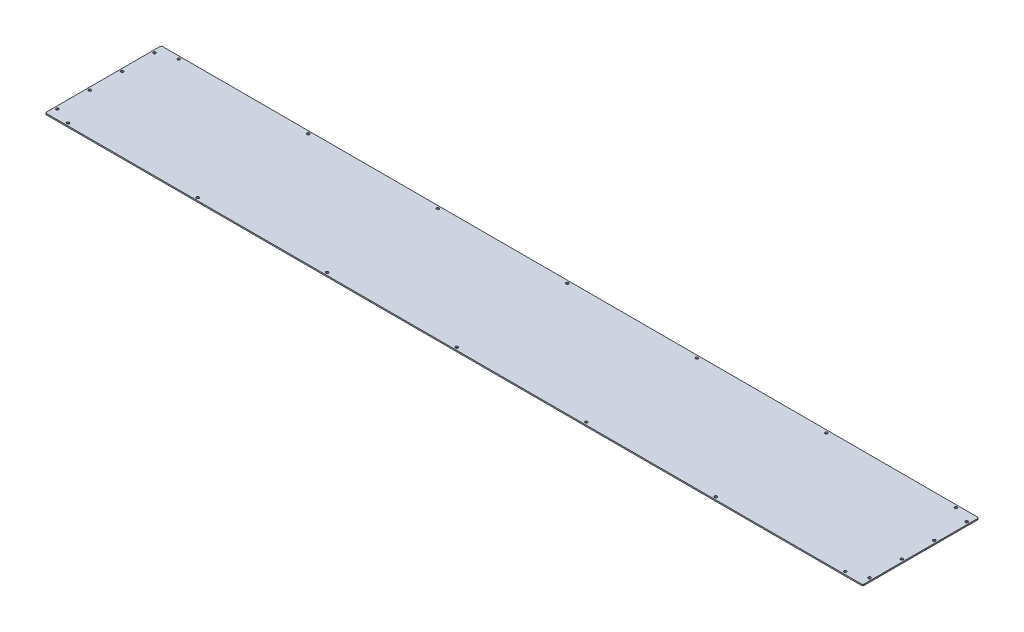
ISO-10303-21;
HEADER;
FILE_DESCRIPTION(('STEP AP214'),'2;1');
FILE_NAME('part.step','',(''),(''),'','','');
FILE_SCHEMA(('AUTOMOTIVE_DESIGN { 1 0 10303 214 1 1 1 1 }'));
ENDSEC;
DATA;
#1=APPLICATION_CONTEXT('core data for automotive mechanical design processes');
#2=APPLICATION_PROTOCOL_DEFINITION('international standard','automotive_design',2000,#1);
#3=PRODUCT_CONTEXT('',#1,'mechanical');
#4=PRODUCT('Part','Part','',(#3));
#5=PRODUCT_RELATED_PRODUCT_CATEGORY('part','',(#4));
#6=PRODUCT_DEFINITION_FORMATION('','',#4);
#7=PRODUCT_DEFINITION_CONTEXT('part definition',#1,'design');
#8=PRODUCT_DEFINITION('design','',#6,#7);
#9=PRODUCT_DEFINITION_SHAPE('','',#8);
#10=(LENGTH_UNIT() NAMED_UNIT(*) SI_UNIT(.MILLI.,.METRE.));
#11=(NAMED_UNIT(*) PLANE_ANGLE_UNIT() SI_UNIT($,.RADIAN.));
#12=(NAMED_UNIT(*) SI_UNIT($,.STERADIAN.) SOLID_ANGLE_UNIT());
#13=UNCERTAINTY_MEASURE_WITH_UNIT(LENGTH_MEASURE(1.E-05),#10,'distance_accuracy_value','');
#14=(GEOMETRIC_REPRESENTATION_CONTEXT(3) GLOBAL_UNCERTAINTY_ASSIGNED_CONTEXT((#13)) GLOBAL_UNIT_ASSIGNED_CONTEXT((#10,
#11,#12)) REPRESENTATION_CONTEXT('',''));
#15=CARTESIAN_POINT('',(0.,0.,0.));
#16=DIRECTION('',(0.,0.,1.));
#17=DIRECTION('',(1.,0.,0.));
#18=AXIS2_PLACEMENT_3D('',#15,#16,#17);
#19=CARTESIAN_POINT('',(962.025,2.9972,-136.525));
#20=DIRECTION('',(-1.,0.,0.));
#21=DIRECTION('',(0.,0.,1.));
#22=AXIS2_PLACEMENT_3D('',#19,#20,#21);
#23=PLANE('',#22);
#24=DIRECTION('',(0.,0.,-1.));
#25=VECTOR('',#24,1.);
#26=CARTESIAN_POINT('',(962.025,2.9972,-136.525));
#27=LINE('',#26,#25);
#28=CARTESIAN_POINT('',(962.025,2.9972,133.35));
#29=VERTEX_POINT('',#28);
#30=CARTESIAN_POINT('',(962.025,2.9972,-133.35));
#31=VERTEX_POINT('',#30);
#32=EDGE_CURVE('E118',#29,#31,#27,.T.);
#33=ORIENTED_EDGE('',*,*,#32,.F.);
#34=DIRECTION('',(0.,-1.,0.));
#35=VECTOR('',#34,1.);
#36=CARTESIAN_POINT('',(962.025,2.9972,133.35));
#37=LINE('',#36,#35);
#38=CARTESIAN_POINT('',(962.025,0.,133.35));
#39=VERTEX_POINT('',#38);
#40=EDGE_CURVE('E103',#29,#39,#37,.T.);
#41=ORIENTED_EDGE('',*,*,#40,.T.);
#42=DIRECTION('',(0.,0.,-1.));
#43=VECTOR('',#42,1.);
#44=CARTESIAN_POINT('',(962.025,0.,-136.525));
#45=LINE('',#44,#43);
#46=CARTESIAN_POINT('',(962.025,0.,-133.35));
#47=VERTEX_POINT('',#46);
#48=EDGE_CURVE('E115',#39,#47,#45,.T.);
#49=ORIENTED_EDGE('',*,*,#48,.T.);
#50=DIRECTION('',(0.,-1.,0.));
#51=VECTOR('',#50,1.);
#52=CARTESIAN_POINT('',(962.025,2.9972,-133.35));
#53=LINE('',#52,#51);
#54=EDGE_CURVE('E120',#47,#31,#53,.F.);
#55=ORIENTED_EDGE('',*,*,#54,.T.);
#56=EDGE_LOOP('',(#33,#41,#49,#55));
#57=FACE_BOUND('',#56,.T.);
#58=ADVANCED_FACE('F34',(#57),#23,.F.);
#59=CARTESIAN_POINT('',(-962.025,2.9972,-136.525));
#60=DIRECTION('',(0.,0.,1.));
#61=DIRECTION('',(1.,0.,0.));
#62=AXIS2_PLACEMENT_3D('',#59,#60,#61);
#63=PLANE('',#62);
#64=DIRECTION('',(-1.,0.,0.));
#65=VECTOR('',#64,1.);
#66=CARTESIAN_POINT('',(-962.025,2.9972,-136.525));
#67=LINE('',#66,#65);
#68=CARTESIAN_POINT('',(958.85,2.9972,-136.525));
#69=VERTEX_POINT('',#68);
#70=CARTESIAN_POINT('',(-958.85,2.9972,-136.525));
#71=VERTEX_POINT('',#70);
#72=EDGE_CURVE('E173',#69,#71,#67,.T.);
#73=ORIENTED_EDGE('',*,*,#72,.F.);
#74=DIRECTION('',(0.,-1.,0.));
#75=VECTOR('',#74,1.);
#76=CARTESIAN_POINT('',(958.85,2.9972,-136.525));
#77=LINE('',#76,#75);
#78=CARTESIAN_POINT('',(958.85,0.,-136.525));
#79=VERTEX_POINT('',#78);
#80=EDGE_CURVE('E157',#69,#79,#77,.T.);
#81=ORIENTED_EDGE('',*,*,#80,.T.);
#82=DIRECTION('',(-1.,0.,0.));
#83=VECTOR('',#82,1.);
#84=CARTESIAN_POINT('',(-962.025,0.,-136.525));
#85=LINE('',#84,#83);
#86=CARTESIAN_POINT('',(-958.85,0.,-136.525));
#87=VERTEX_POINT('',#86);
#88=EDGE_CURVE('E124',#79,#87,#85,.T.);
#89=ORIENTED_EDGE('',*,*,#88,.T.);
#90=DIRECTION('',(0.,-1.,0.));
#91=VECTOR('',#90,1.);
#92=CARTESIAN_POINT('',(-958.85,2.9972,-136.525));
#93=LINE('',#92,#91);
#94=EDGE_CURVE('E155',#87,#71,#93,.F.);
#95=ORIENTED_EDGE('',*,*,#94,.T.);
#96=EDGE_LOOP('',(#73,#81,#89,#95));
#97=FACE_BOUND('',#96,.T.);
#98=ADVANCED_FACE('F368',(#97),#63,.F.);
#99=CARTESIAN_POINT('',(-962.025,2.9972,-136.525));
#100=DIRECTION('',(1.,0.,0.));
#101=DIRECTION('',(0.,0.,-1.));
#102=AXIS2_PLACEMENT_3D('',#99,#100,#101);
#103=PLANE('',#102);
#104=DIRECTION('',(0.,0.,1.));
#105=VECTOR('',#104,1.);
#106=CARTESIAN_POINT('',(-962.025,0.,-136.525));
#107=LINE('',#106,#105);
#108=CARTESIAN_POINT('',(-962.025,0.,-133.35));
#109=VERTEX_POINT('',#108);
#110=CARTESIAN_POINT('',(-962.025,0.,133.35));
#111=VERTEX_POINT('',#110);
#112=EDGE_CURVE('E128',#109,#111,#107,.T.);
#113=ORIENTED_EDGE('',*,*,#112,.T.);
#114=DIRECTION('',(0.,-1.,0.));
#115=VECTOR('',#114,1.);
#116=CARTESIAN_POINT('',(-962.025,2.9972,133.35));
#117=LINE('',#116,#115);
#118=CARTESIAN_POINT('',(-962.025,2.9972,133.35));
#119=VERTEX_POINT('',#118);
#120=EDGE_CURVE('E11',#111,#119,#117,.F.);
#121=ORIENTED_EDGE('',*,*,#120,.T.);
#122=DIRECTION('',(0.,0.,1.));
#123=VECTOR('',#122,1.);
#124=CARTESIAN_POINT('',(-962.025,2.9972,-136.525));
#125=LINE('',#124,#123);
#126=CARTESIAN_POINT('',(-962.025,2.9972,-133.35));
#127=VERTEX_POINT('',#126);
#128=EDGE_CURVE('E163',#127,#119,#125,.T.);
#129=ORIENTED_EDGE('',*,*,#128,.F.);
#130=DIRECTION('',(0.,-1.,0.));
#131=VECTOR('',#130,1.);
#132=CARTESIAN_POINT('',(-962.025,2.9972,-133.35));
#133=LINE('',#132,#131);
#134=EDGE_CURVE('E42',#127,#109,#133,.T.);
#135=ORIENTED_EDGE('',*,*,#134,.T.);
#136=EDGE_LOOP('',(#113,#121,#129,#135));
#137=FACE_BOUND('',#136,.T.);
#138=ADVANCED_FACE('F162',(#137),#103,.F.);
#139=CARTESIAN_POINT('',(-962.025,2.9972,136.525));
#140=DIRECTION('',(0.,0.,-1.));
#141=DIRECTION('',(-1.,0.,0.));
#142=AXIS2_PLACEMENT_3D('',#139,#140,#141);
#143=PLANE('',#142);
#144=DIRECTION('',(1.,0.,0.));
#145=VECTOR('',#144,1.);
#146=CARTESIAN_POINT('',(-962.025,0.,136.525));
#147=LINE('',#146,#145);
#148=CARTESIAN_POINT('',(-958.85,0.,136.525));
#149=VERTEX_POINT('',#148);
#150=CARTESIAN_POINT('',(958.849999999999,0.,136.525));
#151=VERTEX_POINT('',#150);
#152=EDGE_CURVE('E138',#149,#151,#147,.T.);
#153=ORIENTED_EDGE('',*,*,#152,.T.);
#154=DIRECTION('',(0.,-1.,0.));
#155=VECTOR('',#154,1.);
#156=CARTESIAN_POINT('',(958.85,2.9972,136.525));
#157=LINE('',#156,#155);
#158=CARTESIAN_POINT('',(958.849999999999,2.9972,136.525));
#159=VERTEX_POINT('',#158);
#160=EDGE_CURVE('E104',#151,#159,#157,.F.);
#161=ORIENTED_EDGE('',*,*,#160,.T.);
#162=DIRECTION('',(1.,0.,0.));
#163=VECTOR('',#162,1.);
#164=CARTESIAN_POINT('',(-962.025,2.9972,136.525));
#165=LINE('',#164,#163);
#166=CARTESIAN_POINT('',(-958.85,2.9972,136.525));
#167=VERTEX_POINT('',#166);
#168=EDGE_CURVE('E134',#167,#159,#165,.T.);
#169=ORIENTED_EDGE('',*,*,#168,.F.);
#170=DIRECTION('',(0.,-1.,0.));
#171=VECTOR('',#170,1.);
#172=CARTESIAN_POINT('',(-958.85,2.9972,136.525));
#173=LINE('',#172,#171);
#174=EDGE_CURVE('E109',#167,#149,#173,.T.);
#175=ORIENTED_EDGE('',*,*,#174,.T.);
#176=EDGE_LOOP('',(#153,#161,#169,#175));
#177=FACE_BOUND('',#176,.T.);
#178=ADVANCED_FACE('F171',(#177),#143,.F.);
#179=CARTESIAN_POINT('',(0.,2.9972,0.));
#180=DIRECTION('',(0.,1.,0.));
#181=DIRECTION('',(0.,0.,1.));
#182=AXIS2_PLACEMENT_3D('',#179,#180,#181);
#183=PLANE('',#182);
#184=CARTESIAN_POINT('',(0.,2.9972,130.175));
#185=DIRECTION('',(0.,1.,0.));
#186=DIRECTION('',(0.,0.,1.));
#187=AXIS2_PLACEMENT_3D('',#184,#185,#186);
#188=CIRCLE('',#187,3.17499999999999);
#189=CARTESIAN_POINT('',(0.,2.9972,133.35));
#190=VERTEX_POINT('',#189);
#191=EDGE_CURVE('E302',#190,#190,#188,.T.);
#192=ORIENTED_EDGE('',*,*,#191,.F.);
#193=EDGE_LOOP('',(#192));
#194=FACE_BOUND('',#193,.T.);
#195=CARTESIAN_POINT('',(-955.675000000001,2.9972,-38.1));
#196=DIRECTION('',(0.,1.,0.));
#197=DIRECTION('',(0.,0.,1.));
#198=AXIS2_PLACEMENT_3D('',#195,#196,#197);
#199=CIRCLE('',#198,3.17500000000004);
#200=CARTESIAN_POINT('',(-955.675000000001,2.9972,-34.925));
#201=VERTEX_POINT('',#200);
#202=EDGE_CURVE('E296',#201,#201,#199,.T.);
#203=ORIENTED_EDGE('',*,*,#202,.F.);
#204=EDGE_LOOP('',(#203));
#205=FACE_BOUND('',#204,.T.);
#206=CARTESIAN_POINT('',(-955.675000000001,2.9972,38.1));
#207=DIRECTION('',(0.,1.,0.));
#208=DIRECTION('',(0.,0.,1.));
#209=AXIS2_PLACEMENT_3D('',#206,#207,#208);
#210=CIRCLE('',#209,3.17500000000004);
#211=CARTESIAN_POINT('',(-955.675000000001,2.9972,41.275));
#212=VERTEX_POINT('',#211);
#213=EDGE_CURVE('E290',#212,#212,#210,.T.);
#214=ORIENTED_EDGE('',*,*,#213,.F.);
#215=EDGE_LOOP('',(#214));
#216=FACE_BOUND('',#215,.T.);
#217=CARTESIAN_POINT('',(-914.4,2.9972,130.175));
#218=DIRECTION('',(0.,1.,0.));
#219=DIRECTION('',(0.,0.,1.));
#220=AXIS2_PLACEMENT_3D('',#217,#218,#219);
#221=CIRCLE('',#220,3.17500000000004);
#222=CARTESIAN_POINT('',(-914.4,2.9972,133.35));
#223=VERTEX_POINT('',#222);
#224=EDGE_CURVE('E284',#223,#223,#221,.T.);
#225=ORIENTED_EDGE('',*,*,#224,.F.);
#226=EDGE_LOOP('',(#225));
#227=FACE_BOUND('',#226,.T.);
#228=CARTESIAN_POINT('',(-609.6,2.9972,130.175));
#229=DIRECTION('',(0.,1.,0.));
#230=DIRECTION('',(0.,0.,1.));
#231=AXIS2_PLACEMENT_3D('',#228,#229,#230);
#232=CIRCLE('',#231,3.17500000000004);
#233=CARTESIAN_POINT('',(-609.6,2.9972,133.35));
#234=VERTEX_POINT('',#233);
#235=EDGE_CURVE('E278',#234,#234,#232,.T.);
#236=ORIENTED_EDGE('',*,*,#235,.F.);
#237=EDGE_LOOP('',(#236));
#238=FACE_BOUND('',#237,.T.);
#239=CARTESIAN_POINT('',(-304.8,2.9972,130.175));
#240=DIRECTION('',(0.,1.,0.));
#241=DIRECTION('',(0.,0.,1.));
#242=AXIS2_PLACEMENT_3D('',#239,#240,#241);
#243=CIRCLE('',#242,3.17499999999998);
#244=CARTESIAN_POINT('',(-304.8,2.9972,133.35));
#245=VERTEX_POINT('',#244);
#246=EDGE_CURVE('E272',#245,#245,#243,.T.);
#247=ORIENTED_EDGE('',*,*,#246,.F.);
#248=EDGE_LOOP('',(#247));
#249=FACE_BOUND('',#248,.T.);
#250=CARTESIAN_POINT('',(304.8,2.9972,130.175));
#251=DIRECTION('',(0.,1.,0.));
#252=DIRECTION('',(0.,0.,1.));
#253=AXIS2_PLACEMENT_3D('',#250,#251,#252);
#254=CIRCLE('',#253,3.17499999999998);
#255=CARTESIAN_POINT('',(304.8,2.9972,133.35));
#256=VERTEX_POINT('',#255);
#257=EDGE_CURVE('E266',#256,#256,#254,.T.);
#258=ORIENTED_EDGE('',*,*,#257,.F.);
#259=EDGE_LOOP('',(#258));
#260=FACE_BOUND('',#259,.T.);
#261=CARTESIAN_POINT('',(609.6,2.9972,130.175));
#262=DIRECTION('',(0.,1.,0.));
#263=DIRECTION('',(0.,0.,1.));
#264=AXIS2_PLACEMENT_3D('',#261,#262,#263);
#265=CIRCLE('',#264,3.17500000000004);
#266=CARTESIAN_POINT('',(609.6,2.9972,133.35));
#267=VERTEX_POINT('',#266);
#268=EDGE_CURVE('E260',#267,#267,#265,.T.);
#269=ORIENTED_EDGE('',*,*,#268,.F.);
#270=EDGE_LOOP('',(#269));
#271=FACE_BOUND('',#270,.T.);
#272=CARTESIAN_POINT('',(914.4,2.9972,130.175));
#273=DIRECTION('',(0.,1.,0.));
#274=DIRECTION('',(0.,0.,1.));
#275=AXIS2_PLACEMENT_3D('',#272,#273,#274);
#276=CIRCLE('',#275,3.17500000000004);
#277=CARTESIAN_POINT('',(914.4,2.9972,133.35));
#278=VERTEX_POINT('',#277);
#279=EDGE_CURVE('E254',#278,#278,#276,.T.);
#280=ORIENTED_EDGE('',*,*,#279,.F.);
#281=EDGE_LOOP('',(#280));
#282=FACE_BOUND('',#281,.T.);
#283=CARTESIAN_POINT('',(-955.675000000001,2.9972,114.3));
#284=DIRECTION('',(0.,1.,0.));
#285=DIRECTION('',(0.,0.,1.));
#286=AXIS2_PLACEMENT_3D('',#283,#284,#285);
#287=CIRCLE('',#286,3.17500000000004);
#288=CARTESIAN_POINT('',(-955.675000000001,2.9972,117.475));
#289=VERTEX_POINT('',#288);
#290=EDGE_CURVE('E248',#289,#289,#287,.T.);
#291=ORIENTED_EDGE('',*,*,#290,.F.);
#292=EDGE_LOOP('',(#291));
#293=FACE_BOUND('',#292,.T.);
#294=CARTESIAN_POINT('',(914.4,2.9972,-130.175));
#295=DIRECTION('',(0.,1.,0.));
#296=DIRECTION('',(0.,0.,1.));
#297=AXIS2_PLACEMENT_3D('',#294,#295,#296);
#298=CIRCLE('',#297,3.17500000000004);
#299=CARTESIAN_POINT('',(914.4,2.9972,-127.));
#300=VERTEX_POINT('',#299);
#301=EDGE_CURVE('E242',#300,#300,#298,.T.);
#302=ORIENTED_EDGE('',*,*,#301,.F.);
#303=EDGE_LOOP('',(#302));
#304=FACE_BOUND('',#303,.T.);
#305=CARTESIAN_POINT('',(609.6,2.9972,-130.175));
#306=DIRECTION('',(0.,1.,0.));
#307=DIRECTION('',(0.,0.,1.));
#308=AXIS2_PLACEMENT_3D('',#305,#306,#307);
#309=CIRCLE('',#308,3.17500000000004);
#310=CARTESIAN_POINT('',(609.6,2.9972,-127.));
#311=VERTEX_POINT('',#310);
#312=EDGE_CURVE('E236',#311,#311,#309,.T.);
#313=ORIENTED_EDGE('',*,*,#312,.F.);
#314=EDGE_LOOP('',(#313));
#315=FACE_BOUND('',#314,.T.);
#316=CARTESIAN_POINT('',(304.8,2.9972,-130.175));
#317=DIRECTION('',(0.,1.,0.));
#318=DIRECTION('',(0.,0.,1.));
#319=AXIS2_PLACEMENT_3D('',#316,#317,#318);
#320=CIRCLE('',#319,3.17499999999998);
#321=CARTESIAN_POINT('',(304.8,2.9972,-127.));
#322=VERTEX_POINT('',#321);
#323=EDGE_CURVE('E230',#322,#322,#320,.T.);
#324=ORIENTED_EDGE('',*,*,#323,.F.);
#325=EDGE_LOOP('',(#324));
#326=FACE_BOUND('',#325,.T.);
#327=CARTESIAN_POINT('',(-304.8,2.9972,-130.175));
#328=DIRECTION('',(0.,1.,0.));
#329=DIRECTION('',(0.,0.,1.));
#330=AXIS2_PLACEMENT_3D('',#327,#328,#329);
#331=CIRCLE('',#330,3.17499999999998);
#332=CARTESIAN_POINT('',(-304.8,2.9972,-127.));
#333=VERTEX_POINT('',#332);
#334=EDGE_CURVE('E224',#333,#333,#331,.T.);
#335=ORIENTED_EDGE('',*,*,#334,.F.);
#336=EDGE_LOOP('',(#335));
#337=FACE_BOUND('',#336,.T.);
#338=CARTESIAN_POINT('',(-609.6,2.9972,-130.175));
#339=DIRECTION('',(0.,1.,0.));
#340=DIRECTION('',(0.,0.,1.));
#341=AXIS2_PLACEMENT_3D('',#338,#339,#340);
#342=CIRCLE('',#341,3.17500000000004);
#343=CARTESIAN_POINT('',(-609.6,2.9972,-127.));
#344=VERTEX_POINT('',#343);
#345=EDGE_CURVE('E218',#344,#344,#342,.T.);
#346=ORIENTED_EDGE('',*,*,#345,.F.);
#347=EDGE_LOOP('',(#346));
#348=FACE_BOUND('',#347,.T.);
#349=CARTESIAN_POINT('',(-914.4,2.9972,-130.175));
#350=DIRECTION('',(0.,1.,0.));
#351=DIRECTION('',(0.,0.,1.));
#352=AXIS2_PLACEMENT_3D('',#349,#350,#351);
#353=CIRCLE('',#352,3.17500000000004);
#354=CARTESIAN_POINT('',(-914.4,2.9972,-127.));
#355=VERTEX_POINT('',#354);
#356=EDGE_CURVE('E212',#355,#355,#353,.T.);
#357=ORIENTED_EDGE('',*,*,#356,.F.);
#358=EDGE_LOOP('',(#357));
#359=FACE_BOUND('',#358,.T.);
#360=CARTESIAN_POINT('',(0.,2.9972,-130.175));
#361=DIRECTION('',(0.,1.,0.));
#362=DIRECTION('',(0.,0.,1.));
#363=AXIS2_PLACEMENT_3D('',#360,#361,#362);
#364=CIRCLE('',#363,3.17499999999999);
#365=CARTESIAN_POINT('',(0.,2.9972,-127.));
#366=VERTEX_POINT('',#365);
#367=EDGE_CURVE('E206',#366,#366,#364,.T.);
#368=ORIENTED_EDGE('',*,*,#367,.F.);
#369=EDGE_LOOP('',(#368));
#370=FACE_BOUND('',#369,.T.);
#371=CARTESIAN_POINT('',(955.675000000001,2.9972,114.3));
#372=DIRECTION('',(0.,1.,0.));
#373=DIRECTION('',(0.,0.,1.));
#374=AXIS2_PLACEMENT_3D('',#371,#372,#373);
#375=CIRCLE('',#374,3.17500000000004);
#376=CARTESIAN_POINT('',(955.675000000001,2.9972,117.475));
#377=VERTEX_POINT('',#376);
#378=EDGE_CURVE('E200',#377,#377,#375,.T.);
#379=ORIENTED_EDGE('',*,*,#378,.F.);
#380=EDGE_LOOP('',(#379));
#381=FACE_BOUND('',#380,.T.);
#382=CARTESIAN_POINT('',(955.675000000001,2.9972,38.0999999999998));
#383=DIRECTION('',(0.,1.,0.));
#384=DIRECTION('',(0.,0.,1.));
#385=AXIS2_PLACEMENT_3D('',#382,#383,#384);
#386=CIRCLE('',#385,3.17500000000004);
#387=CARTESIAN_POINT('',(955.675000000001,2.9972,41.2749999999998));
#388=VERTEX_POINT('',#387);
#389=EDGE_CURVE('E194',#388,#388,#386,.T.);
#390=ORIENTED_EDGE('',*,*,#389,.F.);
#391=EDGE_LOOP('',(#390));
#392=FACE_BOUND('',#391,.T.);
#393=CARTESIAN_POINT('',(955.675000000001,2.9972,-38.1000000000003));
#394=DIRECTION('',(0.,1.,0.));
#395=DIRECTION('',(0.,0.,1.));
#396=AXIS2_PLACEMENT_3D('',#393,#394,#395);
#397=CIRCLE('',#396,3.17500000000004);
#398=CARTESIAN_POINT('',(955.675000000001,2.9972,-34.9250000000002));
#399=VERTEX_POINT('',#398);
#400=EDGE_CURVE('E188',#399,#399,#397,.T.);
#401=ORIENTED_EDGE('',*,*,#400,.F.);
#402=EDGE_LOOP('',(#401));
#403=FACE_BOUND('',#402,.T.);
#404=CARTESIAN_POINT('',(-955.675000000001,2.9972,-114.3));
#405=DIRECTION('',(0.,1.,0.));
#406=DIRECTION('',(0.,0.,1.));
#407=AXIS2_PLACEMENT_3D('',#404,#405,#406);
#408=CIRCLE('',#407,3.17500000000004);
#409=CARTESIAN_POINT('',(-955.675000000001,2.9972,-111.125));
#410=VERTEX_POINT('',#409);
#411=EDGE_CURVE('E182',#410,#410,#408,.T.);
#412=ORIENTED_EDGE('',*,*,#411,.F.);
#413=EDGE_LOOP('',(#412));
#414=FACE_BOUND('',#413,.T.);
#415=CARTESIAN_POINT('',(955.675000000001,2.9972,-114.3));
#416=DIRECTION('',(0.,1.,0.));
#417=DIRECTION('',(0.,0.,1.));
#418=AXIS2_PLACEMENT_3D('',#415,#416,#417);
#419=CIRCLE('',#418,3.17500000000004);
#420=CARTESIAN_POINT('',(955.675000000001,2.9972,-111.125));
#421=VERTEX_POINT('',#420);
#422=EDGE_CURVE('E131',#421,#421,#419,.T.);
#423=ORIENTED_EDGE('',*,*,#422,.F.);
#424=EDGE_LOOP('',(#423));
#425=FACE_BOUND('',#424,.T.);
#426=ORIENTED_EDGE('',*,*,#168,.T.);
#427=CARTESIAN_POINT('',(958.85,2.9972,133.35));
#428=DIRECTION('',(0.,1.,0.));
#429=DIRECTION('',(0.,0.,1.));
#430=AXIS2_PLACEMENT_3D('',#427,#428,#429);
#431=CIRCLE('',#430,3.175);
#432=EDGE_CURVE('E153',#159,#29,#431,.T.);
#433=ORIENTED_EDGE('',*,*,#432,.T.);
#434=ORIENTED_EDGE('',*,*,#32,.T.);
#435=CARTESIAN_POINT('',(958.85,2.9972,-133.35));
#436=DIRECTION('',(0.,1.,0.));
#437=DIRECTION('',(0.,0.,1.));
#438=AXIS2_PLACEMENT_3D('',#435,#436,#437);
#439=CIRCLE('',#438,3.175);
#440=EDGE_CURVE('E151',#31,#69,#439,.T.);
#441=ORIENTED_EDGE('',*,*,#440,.T.);
#442=ORIENTED_EDGE('',*,*,#72,.T.);
#443=CARTESIAN_POINT('',(-958.85,2.9972,-133.35));
#444=DIRECTION('',(0.,1.,0.));
#445=DIRECTION('',(0.,0.,1.));
#446=AXIS2_PLACEMENT_3D('',#443,#444,#445);
#447=CIRCLE('',#446,3.175);
#448=EDGE_CURVE('E54',#71,#127,#447,.T.);
#449=ORIENTED_EDGE('',*,*,#448,.T.);
#450=ORIENTED_EDGE('',*,*,#128,.T.);
#451=CARTESIAN_POINT('',(-958.85,2.9972,133.35));
#452=DIRECTION('',(0.,1.,0.));
#453=DIRECTION('',(0.,0.,1.));
#454=AXIS2_PLACEMENT_3D('',#451,#452,#453);
#455=CIRCLE('',#454,3.175);
#456=EDGE_CURVE('E149',#119,#167,#455,.T.);
#457=ORIENTED_EDGE('',*,*,#456,.T.);
#458=EDGE_LOOP('',(#426,#433,#434,#441,#442,#449,#450,#457));
#459=FACE_BOUND('',#458,.T.);
#460=ADVANCED_FACE('F308',(#194,#205,#216,#227,#238,#249,#260,#271,#282,#293,#304,#315,#326,
#337,#348,#359,#370,#381,#392,#403,#414,#425,#459),#183,.T.);
#461=CARTESIAN_POINT('',(0.,0.,0.));
#462=DIRECTION('',(0.,1.,0.));
#463=DIRECTION('',(0.,0.,1.));
#464=AXIS2_PLACEMENT_3D('',#461,#462,#463);
#465=PLANE('',#464);
#466=CARTESIAN_POINT('',(0.,0.,130.175));
#467=DIRECTION('',(0.,1.,0.));
#468=DIRECTION('',(0.,0.,1.));
#469=AXIS2_PLACEMENT_3D('',#466,#467,#468);
#470=CIRCLE('',#469,3.175);
#471=CARTESIAN_POINT('',(0.,0.,133.35));
#472=VERTEX_POINT('',#471);
#473=EDGE_CURVE('E299',#472,#472,#470,.T.);
#474=ORIENTED_EDGE('',*,*,#473,.T.);
#475=EDGE_LOOP('',(#474));
#476=FACE_BOUND('',#475,.T.);
#477=CARTESIAN_POINT('',(-955.675000000001,0.,-38.1));
#478=DIRECTION('',(0.,1.,0.));
#479=DIRECTION('',(0.,0.,1.));
#480=AXIS2_PLACEMENT_3D('',#477,#478,#479);
#481=CIRCLE('',#480,3.17500000000004);
#482=CARTESIAN_POINT('',(-955.675000000001,0.,-34.925));
#483=VERTEX_POINT('',#482);
#484=EDGE_CURVE('E293',#483,#483,#481,.T.);
#485=ORIENTED_EDGE('',*,*,#484,.T.);
#486=EDGE_LOOP('',(#485));
#487=FACE_BOUND('',#486,.T.);
#488=CARTESIAN_POINT('',(-955.675000000001,0.,38.1));
#489=DIRECTION('',(0.,1.,0.));
#490=DIRECTION('',(0.,0.,1.));
#491=AXIS2_PLACEMENT_3D('',#488,#489,#490);
#492=CIRCLE('',#491,3.17500000000004);
#493=CARTESIAN_POINT('',(-955.675000000001,0.,41.275));
#494=VERTEX_POINT('',#493);
#495=EDGE_CURVE('E287',#494,#494,#492,.T.);
#496=ORIENTED_EDGE('',*,*,#495,.T.);
#497=EDGE_LOOP('',(#496));
#498=FACE_BOUND('',#497,.T.);
#499=CARTESIAN_POINT('',(-914.4,0.,130.175));
#500=DIRECTION('',(0.,1.,0.));
#501=DIRECTION('',(0.,0.,1.));
#502=AXIS2_PLACEMENT_3D('',#499,#500,#501);
#503=CIRCLE('',#502,3.17500000000004);
#504=CARTESIAN_POINT('',(-914.4,0.,133.35));
#505=VERTEX_POINT('',#504);
#506=EDGE_CURVE('E281',#505,#505,#503,.T.);
#507=ORIENTED_EDGE('',*,*,#506,.T.);
#508=EDGE_LOOP('',(#507));
#509=FACE_BOUND('',#508,.T.);
#510=CARTESIAN_POINT('',(-609.6,0.,130.175));
#511=DIRECTION('',(0.,1.,0.));
#512=DIRECTION('',(0.,0.,1.));
#513=AXIS2_PLACEMENT_3D('',#510,#511,#512);
#514=CIRCLE('',#513,3.17500000000004);
#515=CARTESIAN_POINT('',(-609.6,0.,133.35));
#516=VERTEX_POINT('',#515);
#517=EDGE_CURVE('E275',#516,#516,#514,.T.);
#518=ORIENTED_EDGE('',*,*,#517,.T.);
#519=EDGE_LOOP('',(#518));
#520=FACE_BOUND('',#519,.T.);
#521=CARTESIAN_POINT('',(-304.8,0.,130.175));
#522=DIRECTION('',(0.,1.,0.));
#523=DIRECTION('',(0.,0.,1.));
#524=AXIS2_PLACEMENT_3D('',#521,#522,#523);
#525=CIRCLE('',#524,3.17499999999998);
#526=CARTESIAN_POINT('',(-304.8,0.,133.35));
#527=VERTEX_POINT('',#526);
#528=EDGE_CURVE('E269',#527,#527,#525,.T.);
#529=ORIENTED_EDGE('',*,*,#528,.T.);
#530=EDGE_LOOP('',(#529));
#531=FACE_BOUND('',#530,.T.);
#532=CARTESIAN_POINT('',(304.8,0.,130.175));
#533=DIRECTION('',(0.,1.,0.));
#534=DIRECTION('',(0.,0.,1.));
#535=AXIS2_PLACEMENT_3D('',#532,#533,#534);
#536=CIRCLE('',#535,3.17499999999998);
#537=CARTESIAN_POINT('',(304.8,0.,133.35));
#538=VERTEX_POINT('',#537);
#539=EDGE_CURVE('E263',#538,#538,#536,.T.);
#540=ORIENTED_EDGE('',*,*,#539,.T.);
#541=EDGE_LOOP('',(#540));
#542=FACE_BOUND('',#541,.T.);
#543=CARTESIAN_POINT('',(609.6,0.,130.175));
#544=DIRECTION('',(0.,1.,0.));
#545=DIRECTION('',(0.,0.,1.));
#546=AXIS2_PLACEMENT_3D('',#543,#544,#545);
#547=CIRCLE('',#546,3.17500000000004);
#548=CARTESIAN_POINT('',(609.6,0.,133.35));
#549=VERTEX_POINT('',#548);
#550=EDGE_CURVE('E257',#549,#549,#547,.T.);
#551=ORIENTED_EDGE('',*,*,#550,.T.);
#552=EDGE_LOOP('',(#551));
#553=FACE_BOUND('',#552,.T.);
#554=CARTESIAN_POINT('',(914.4,0.,130.175));
#555=DIRECTION('',(0.,1.,0.));
#556=DIRECTION('',(0.,0.,1.));
#557=AXIS2_PLACEMENT_3D('',#554,#555,#556);
#558=CIRCLE('',#557,3.17500000000004);
#559=CARTESIAN_POINT('',(914.4,0.,133.35));
#560=VERTEX_POINT('',#559);
#561=EDGE_CURVE('E251',#560,#560,#558,.T.);
#562=ORIENTED_EDGE('',*,*,#561,.T.);
#563=EDGE_LOOP('',(#562));
#564=FACE_BOUND('',#563,.T.);
#565=CARTESIAN_POINT('',(-955.675000000001,0.,114.3));
#566=DIRECTION('',(0.,1.,0.));
#567=DIRECTION('',(0.,0.,1.));
#568=AXIS2_PLACEMENT_3D('',#565,#566,#567);
#569=CIRCLE('',#568,3.17500000000004);
#570=CARTESIAN_POINT('',(-955.675000000001,0.,117.475));
#571=VERTEX_POINT('',#570);
#572=EDGE_CURVE('E245',#571,#571,#569,.T.);
#573=ORIENTED_EDGE('',*,*,#572,.T.);
#574=EDGE_LOOP('',(#573));
#575=FACE_BOUND('',#574,.T.);
#576=CARTESIAN_POINT('',(914.4,0.,-130.175));
#577=DIRECTION('',(0.,1.,0.));
#578=DIRECTION('',(0.,0.,1.));
#579=AXIS2_PLACEMENT_3D('',#576,#577,#578);
#580=CIRCLE('',#579,3.17500000000004);
#581=CARTESIAN_POINT('',(914.4,0.,-127.));
#582=VERTEX_POINT('',#581);
#583=EDGE_CURVE('E239',#582,#582,#580,.T.);
#584=ORIENTED_EDGE('',*,*,#583,.T.);
#585=EDGE_LOOP('',(#584));
#586=FACE_BOUND('',#585,.T.);
#587=CARTESIAN_POINT('',(609.6,0.,-130.175));
#588=DIRECTION('',(0.,1.,0.));
#589=DIRECTION('',(0.,0.,1.));
#590=AXIS2_PLACEMENT_3D('',#587,#588,#589);
#591=CIRCLE('',#590,3.17500000000004);
#592=CARTESIAN_POINT('',(609.6,0.,-127.));
#593=VERTEX_POINT('',#592);
#594=EDGE_CURVE('E233',#593,#593,#591,.T.);
#595=ORIENTED_EDGE('',*,*,#594,.T.);
#596=EDGE_LOOP('',(#595));
#597=FACE_BOUND('',#596,.T.);
#598=CARTESIAN_POINT('',(304.8,0.,-130.175));
#599=DIRECTION('',(0.,1.,0.));
#600=DIRECTION('',(0.,0.,1.));
#601=AXIS2_PLACEMENT_3D('',#598,#599,#600);
#602=CIRCLE('',#601,3.17499999999998);
#603=CARTESIAN_POINT('',(304.8,0.,-127.));
#604=VERTEX_POINT('',#603);
#605=EDGE_CURVE('E227',#604,#604,#602,.T.);
#606=ORIENTED_EDGE('',*,*,#605,.T.);
#607=EDGE_LOOP('',(#606));
#608=FACE_BOUND('',#607,.T.);
#609=CARTESIAN_POINT('',(-304.8,0.,-130.175));
#610=DIRECTION('',(0.,1.,0.));
#611=DIRECTION('',(0.,0.,1.));
#612=AXIS2_PLACEMENT_3D('',#609,#610,#611);
#613=CIRCLE('',#612,3.17499999999998);
#614=CARTESIAN_POINT('',(-304.8,0.,-127.));
#615=VERTEX_POINT('',#614);
#616=EDGE_CURVE('E221',#615,#615,#613,.T.);
#617=ORIENTED_EDGE('',*,*,#616,.T.);
#618=EDGE_LOOP('',(#617));
#619=FACE_BOUND('',#618,.T.);
#620=CARTESIAN_POINT('',(-609.6,0.,-130.175));
#621=DIRECTION('',(0.,1.,0.));
#622=DIRECTION('',(0.,0.,1.));
#623=AXIS2_PLACEMENT_3D('',#620,#621,#622);
#624=CIRCLE('',#623,3.17500000000004);
#625=CARTESIAN_POINT('',(-609.6,0.,-127.));
#626=VERTEX_POINT('',#625);
#627=EDGE_CURVE('E215',#626,#626,#624,.T.);
#628=ORIENTED_EDGE('',*,*,#627,.T.);
#629=EDGE_LOOP('',(#628));
#630=FACE_BOUND('',#629,.T.);
#631=CARTESIAN_POINT('',(-914.4,0.,-130.175));
#632=DIRECTION('',(0.,1.,0.));
#633=DIRECTION('',(0.,0.,1.));
#634=AXIS2_PLACEMENT_3D('',#631,#632,#633);
#635=CIRCLE('',#634,3.17500000000004);
#636=CARTESIAN_POINT('',(-914.4,0.,-127.));
#637=VERTEX_POINT('',#636);
#638=EDGE_CURVE('E209',#637,#637,#635,.T.);
#639=ORIENTED_EDGE('',*,*,#638,.T.);
#640=EDGE_LOOP('',(#639));
#641=FACE_BOUND('',#640,.T.);
#642=CARTESIAN_POINT('',(0.,0.,-130.175));
#643=DIRECTION('',(0.,1.,0.));
#644=DIRECTION('',(0.,0.,1.));
#645=AXIS2_PLACEMENT_3D('',#642,#643,#644);
#646=CIRCLE('',#645,3.175);
#647=CARTESIAN_POINT('',(0.,0.,-127.));
#648=VERTEX_POINT('',#647);
#649=EDGE_CURVE('E203',#648,#648,#646,.T.);
#650=ORIENTED_EDGE('',*,*,#649,.T.);
#651=EDGE_LOOP('',(#650));
#652=FACE_BOUND('',#651,.T.);
#653=CARTESIAN_POINT('',(955.675000000001,0.,114.3));
#654=DIRECTION('',(0.,1.,0.));
#655=DIRECTION('',(0.,0.,1.));
#656=AXIS2_PLACEMENT_3D('',#653,#654,#655);
#657=CIRCLE('',#656,3.17500000000004);
#658=CARTESIAN_POINT('',(955.675000000001,0.,117.475));
#659=VERTEX_POINT('',#658);
#660=EDGE_CURVE('E197',#659,#659,#657,.T.);
#661=ORIENTED_EDGE('',*,*,#660,.T.);
#662=EDGE_LOOP('',(#661));
#663=FACE_BOUND('',#662,.T.);
#664=CARTESIAN_POINT('',(955.675000000001,0.,38.0999999999998));
#665=DIRECTION('',(0.,1.,0.));
#666=DIRECTION('',(0.,0.,1.));
#667=AXIS2_PLACEMENT_3D('',#664,#665,#666);
#668=CIRCLE('',#667,3.17500000000004);
#669=CARTESIAN_POINT('',(955.675000000001,0.,41.2749999999998));
#670=VERTEX_POINT('',#669);
#671=EDGE_CURVE('E191',#670,#670,#668,.T.);
#672=ORIENTED_EDGE('',*,*,#671,.T.);
#673=EDGE_LOOP('',(#672));
#674=FACE_BOUND('',#673,.T.);
#675=CARTESIAN_POINT('',(955.675000000001,0.,-38.1000000000003));
#676=DIRECTION('',(0.,1.,0.));
#677=DIRECTION('',(0.,0.,1.));
#678=AXIS2_PLACEMENT_3D('',#675,#676,#677);
#679=CIRCLE('',#678,3.17500000000004);
#680=CARTESIAN_POINT('',(955.675000000001,0.,-34.9250000000002));
#681=VERTEX_POINT('',#680);
#682=EDGE_CURVE('E185',#681,#681,#679,.T.);
#683=ORIENTED_EDGE('',*,*,#682,.T.);
#684=EDGE_LOOP('',(#683));
#685=FACE_BOUND('',#684,.T.);
#686=CARTESIAN_POINT('',(-955.675000000001,0.,-114.3));
#687=DIRECTION('',(0.,1.,0.));
#688=DIRECTION('',(0.,0.,1.));
#689=AXIS2_PLACEMENT_3D('',#686,#687,#688);
#690=CIRCLE('',#689,3.17500000000004);
#691=CARTESIAN_POINT('',(-955.675000000001,0.,-111.125));
#692=VERTEX_POINT('',#691);
#693=EDGE_CURVE('E179',#692,#692,#690,.T.);
#694=ORIENTED_EDGE('',*,*,#693,.T.);
#695=EDGE_LOOP('',(#694));
#696=FACE_BOUND('',#695,.T.);
#697=CARTESIAN_POINT('',(955.675000000001,0.,-114.3));
#698=DIRECTION('',(0.,1.,0.));
#699=DIRECTION('',(0.,0.,1.));
#700=AXIS2_PLACEMENT_3D('',#697,#698,#699);
#701=CIRCLE('',#700,3.17500000000004);
#702=CARTESIAN_POINT('',(955.675000000001,0.,-111.125));
#703=VERTEX_POINT('',#702);
#704=EDGE_CURVE('E125',#703,#703,#701,.T.);
#705=ORIENTED_EDGE('',*,*,#704,.T.);
#706=EDGE_LOOP('',(#705));
#707=FACE_BOUND('',#706,.T.);
#708=ORIENTED_EDGE('',*,*,#48,.F.);
#709=CARTESIAN_POINT('',(958.85,0.,133.35));
#710=DIRECTION('',(0.,1.,0.));
#711=DIRECTION('',(0.,0.,1.));
#712=AXIS2_PLACEMENT_3D('',#709,#710,#711);
#713=CIRCLE('',#712,3.175);
#714=EDGE_CURVE('E99',#39,#151,#713,.F.);
#715=ORIENTED_EDGE('',*,*,#714,.T.);
#716=ORIENTED_EDGE('',*,*,#152,.F.);
#717=CARTESIAN_POINT('',(-958.85,0.,133.35));
#718=DIRECTION('',(0.,1.,0.));
#719=DIRECTION('',(0.,0.,1.));
#720=AXIS2_PLACEMENT_3D('',#717,#718,#719);
#721=CIRCLE('',#720,3.175);
#722=EDGE_CURVE('E142',#149,#111,#721,.F.);
#723=ORIENTED_EDGE('',*,*,#722,.T.);
#724=ORIENTED_EDGE('',*,*,#112,.F.);
#725=CARTESIAN_POINT('',(-958.85,0.,-133.35));
#726=DIRECTION('',(0.,1.,0.));
#727=DIRECTION('',(0.,0.,1.));
#728=AXIS2_PLACEMENT_3D('',#725,#726,#727);
#729=CIRCLE('',#728,3.175);
#730=EDGE_CURVE('E119',#109,#87,#729,.F.);
#731=ORIENTED_EDGE('',*,*,#730,.T.);
#732=ORIENTED_EDGE('',*,*,#88,.F.);
#733=CARTESIAN_POINT('',(958.85,0.,-133.35));
#734=DIRECTION('',(0.,1.,0.));
#735=DIRECTION('',(0.,0.,1.));
#736=AXIS2_PLACEMENT_3D('',#733,#734,#735);
#737=CIRCLE('',#736,3.175);
#738=EDGE_CURVE('E110',#79,#47,#737,.F.);
#739=ORIENTED_EDGE('',*,*,#738,.T.);
#740=EDGE_LOOP('',(#708,#715,#716,#723,#724,#731,#732,#739));
#741=FACE_BOUND('',#740,.T.);
#742=ADVANCED_FACE('F122',(#476,#487,#498,#509,#520,#531,#542,#553,#564,#575,#586,#597,#608,
#619,#630,#641,#652,#663,#674,#685,#696,#707,#741),#465,.F.);
#743=CARTESIAN_POINT('',(958.85,2.9972,133.35));
#744=DIRECTION('',(0.,-1.,0.));
#745=DIRECTION('',(0.,0.,-1.));
#746=AXIS2_PLACEMENT_3D('',#743,#744,#745);
#747=CYLINDRICAL_SURFACE('',#746,3.175);
#748=ORIENTED_EDGE('',*,*,#432,.F.);
#749=ORIENTED_EDGE('',*,*,#160,.F.);
#750=ORIENTED_EDGE('',*,*,#714,.F.);
#751=ORIENTED_EDGE('',*,*,#40,.F.);
#752=EDGE_LOOP('',(#748,#749,#750,#751));
#753=FACE_BOUND('',#752,.T.);
#754=ADVANCED_FACE('F102',(#753),#747,.T.);
#755=CARTESIAN_POINT('',(958.85,2.9972,-133.35));
#756=DIRECTION('',(0.,-1.,0.));
#757=DIRECTION('',(0.,0.,-1.));
#758=AXIS2_PLACEMENT_3D('',#755,#756,#757);
#759=CYLINDRICAL_SURFACE('',#758,3.175);
#760=ORIENTED_EDGE('',*,*,#440,.F.);
#761=ORIENTED_EDGE('',*,*,#54,.F.);
#762=ORIENTED_EDGE('',*,*,#738,.F.);
#763=ORIENTED_EDGE('',*,*,#80,.F.);
#764=EDGE_LOOP('',(#760,#761,#762,#763));
#765=FACE_BOUND('',#764,.T.);
#766=ADVANCED_FACE('F379',(#765),#759,.T.);
#767=CARTESIAN_POINT('',(-958.85,2.9972,133.35));
#768=DIRECTION('',(0.,-1.,0.));
#769=DIRECTION('',(0.,0.,-1.));
#770=AXIS2_PLACEMENT_3D('',#767,#768,#769);
#771=CYLINDRICAL_SURFACE('',#770,3.175);
#772=ORIENTED_EDGE('',*,*,#456,.F.);
#773=ORIENTED_EDGE('',*,*,#120,.F.);
#774=ORIENTED_EDGE('',*,*,#722,.F.);
#775=ORIENTED_EDGE('',*,*,#174,.F.);
#776=EDGE_LOOP('',(#772,#773,#774,#775));
#777=FACE_BOUND('',#776,.T.);
#778=ADVANCED_FACE('F168',(#777),#771,.T.);
#779=CARTESIAN_POINT('',(-958.85,2.9972,-133.35));
#780=DIRECTION('',(0.,-1.,0.));
#781=DIRECTION('',(0.,0.,-1.));
#782=AXIS2_PLACEMENT_3D('',#779,#780,#781);
#783=CYLINDRICAL_SURFACE('',#782,3.175);
#784=ORIENTED_EDGE('',*,*,#448,.F.);
#785=ORIENTED_EDGE('',*,*,#94,.F.);
#786=ORIENTED_EDGE('',*,*,#730,.F.);
#787=ORIENTED_EDGE('',*,*,#134,.F.);
#788=EDGE_LOOP('',(#784,#785,#786,#787));
#789=FACE_BOUND('',#788,.T.);
#790=ADVANCED_FACE('F36',(#789),#783,.T.);
#791=CARTESIAN_POINT('',(955.675000000001,2.9972,-114.3));
#792=DIRECTION('',(0.,1.,0.));
#793=DIRECTION('',(0.,0.,1.));
#794=AXIS2_PLACEMENT_3D('',#791,#792,#793);
#795=CYLINDRICAL_SURFACE('',#794,3.17500000000004);
#796=ORIENTED_EDGE('',*,*,#704,.F.);
#797=EDGE_LOOP('',(#796));
#798=FACE_BOUND('',#797,.T.);
#799=ORIENTED_EDGE('',*,*,#422,.T.);
#800=EDGE_LOOP('',(#799));
#801=FACE_BOUND('',#800,.T.);
#802=ADVANCED_FACE('F354',(#798,#801),#795,.F.);
#803=CARTESIAN_POINT('',(-955.675000000001,2.9972,-114.3));
#804=DIRECTION('',(0.,1.,0.));
#805=DIRECTION('',(0.,0.,1.));
#806=AXIS2_PLACEMENT_3D('',#803,#804,#805);
#807=CYLINDRICAL_SURFACE('',#806,3.17500000000004);
#808=ORIENTED_EDGE('',*,*,#693,.F.);
#809=EDGE_LOOP('',(#808));
#810=FACE_BOUND('',#809,.T.);
#811=ORIENTED_EDGE('',*,*,#411,.T.);
#812=EDGE_LOOP('',(#811));
#813=FACE_BOUND('',#812,.T.);
#814=ADVANCED_FACE('F356',(#810,#813),#807,.F.);
#815=CARTESIAN_POINT('',(955.675000000001,2.9972,-38.1000000000003));
#816=DIRECTION('',(0.,1.,0.));
#817=DIRECTION('',(0.,0.,1.));
#818=AXIS2_PLACEMENT_3D('',#815,#816,#817);
#819=CYLINDRICAL_SURFACE('',#818,3.17500000000004);
#820=ORIENTED_EDGE('',*,*,#682,.F.);
#821=EDGE_LOOP('',(#820));
#822=FACE_BOUND('',#821,.T.);
#823=ORIENTED_EDGE('',*,*,#400,.T.);
#824=EDGE_LOOP('',(#823));
#825=FACE_BOUND('',#824,.T.);
#826=ADVANCED_FACE('F363',(#822,#825),#819,.F.);
#827=CARTESIAN_POINT('',(955.675000000001,2.9972,38.0999999999998));
#828=DIRECTION('',(0.,1.,0.));
#829=DIRECTION('',(0.,0.,1.));
#830=AXIS2_PLACEMENT_3D('',#827,#828,#829);
#831=CYLINDRICAL_SURFACE('',#830,3.17500000000004);
#832=ORIENTED_EDGE('',*,*,#671,.F.);
#833=EDGE_LOOP('',(#832));
#834=FACE_BOUND('',#833,.T.);
#835=ORIENTED_EDGE('',*,*,#389,.T.);
#836=EDGE_LOOP('',(#835));
#837=FACE_BOUND('',#836,.T.);
#838=ADVANCED_FACE('F428',(#834,#837),#831,.F.);
#839=CARTESIAN_POINT('',(955.675000000001,2.9972,114.3));
#840=DIRECTION('',(0.,1.,0.));
#841=DIRECTION('',(0.,0.,1.));
#842=AXIS2_PLACEMENT_3D('',#839,#840,#841);
#843=CYLINDRICAL_SURFACE('',#842,3.17500000000004);
#844=ORIENTED_EDGE('',*,*,#660,.F.);
#845=EDGE_LOOP('',(#844));
#846=FACE_BOUND('',#845,.T.);
#847=ORIENTED_EDGE('',*,*,#378,.T.);
#848=EDGE_LOOP('',(#847));
#849=FACE_BOUND('',#848,.T.);
#850=ADVANCED_FACE('F438',(#846,#849),#843,.F.);
#851=CARTESIAN_POINT('',(0.,2.9972,-130.175));
#852=DIRECTION('',(0.,1.,0.));
#853=DIRECTION('',(0.,0.,1.));
#854=AXIS2_PLACEMENT_3D('',#851,#852,#853);
#855=CYLINDRICAL_SURFACE('',#854,3.17499999999999);
#856=ORIENTED_EDGE('',*,*,#649,.F.);
#857=EDGE_LOOP('',(#856));
#858=FACE_BOUND('',#857,.T.);
#859=ORIENTED_EDGE('',*,*,#367,.T.);
#860=EDGE_LOOP('',(#859));
#861=FACE_BOUND('',#860,.T.);
#862=ADVANCED_FACE('F448',(#858,#861),#855,.F.);
#863=CARTESIAN_POINT('',(-914.4,2.9972,-130.175));
#864=DIRECTION('',(0.,1.,0.));
#865=DIRECTION('',(0.,0.,1.));
#866=AXIS2_PLACEMENT_3D('',#863,#864,#865);
#867=CYLINDRICAL_SURFACE('',#866,3.17500000000004);
#868=ORIENTED_EDGE('',*,*,#638,.F.);
#869=EDGE_LOOP('',(#868));
#870=FACE_BOUND('',#869,.T.);
#871=ORIENTED_EDGE('',*,*,#356,.T.);
#872=EDGE_LOOP('',(#871));
#873=FACE_BOUND('',#872,.T.);
#874=ADVANCED_FACE('F458',(#870,#873),#867,.F.);
#875=CARTESIAN_POINT('',(-609.6,2.9972,-130.175));
#876=DIRECTION('',(0.,1.,0.));
#877=DIRECTION('',(0.,0.,1.));
#878=AXIS2_PLACEMENT_3D('',#875,#876,#877);
#879=CYLINDRICAL_SURFACE('',#878,3.17500000000004);
#880=ORIENTED_EDGE('',*,*,#627,.F.);
#881=EDGE_LOOP('',(#880));
#882=FACE_BOUND('',#881,.T.);
#883=ORIENTED_EDGE('',*,*,#345,.T.);
#884=EDGE_LOOP('',(#883));
#885=FACE_BOUND('',#884,.T.);
#886=ADVANCED_FACE('F468',(#882,#885),#879,.F.);
#887=CARTESIAN_POINT('',(-304.8,2.9972,-130.175));
#888=DIRECTION('',(0.,1.,0.));
#889=DIRECTION('',(0.,0.,1.));
#890=AXIS2_PLACEMENT_3D('',#887,#888,#889);
#891=CYLINDRICAL_SURFACE('',#890,3.17499999999998);
#892=ORIENTED_EDGE('',*,*,#616,.F.);
#893=EDGE_LOOP('',(#892));
#894=FACE_BOUND('',#893,.T.);
#895=ORIENTED_EDGE('',*,*,#334,.T.);
#896=EDGE_LOOP('',(#895));
#897=FACE_BOUND('',#896,.T.);
#898=ADVANCED_FACE('F478',(#894,#897),#891,.F.);
#899=CARTESIAN_POINT('',(304.8,2.9972,-130.175));
#900=DIRECTION('',(0.,1.,0.));
#901=DIRECTION('',(0.,0.,1.));
#902=AXIS2_PLACEMENT_3D('',#899,#900,#901);
#903=CYLINDRICAL_SURFACE('',#902,3.17499999999998);
#904=ORIENTED_EDGE('',*,*,#605,.F.);
#905=EDGE_LOOP('',(#904));
#906=FACE_BOUND('',#905,.T.);
#907=ORIENTED_EDGE('',*,*,#323,.T.);
#908=EDGE_LOOP('',(#907));
#909=FACE_BOUND('',#908,.T.);
#910=ADVANCED_FACE('F488',(#906,#909),#903,.F.);
#911=CARTESIAN_POINT('',(609.6,2.9972,-130.175));
#912=DIRECTION('',(0.,1.,0.));
#913=DIRECTION('',(0.,0.,1.));
#914=AXIS2_PLACEMENT_3D('',#911,#912,#913);
#915=CYLINDRICAL_SURFACE('',#914,3.17500000000004);
#916=ORIENTED_EDGE('',*,*,#594,.F.);
#917=EDGE_LOOP('',(#916));
#918=FACE_BOUND('',#917,.T.);
#919=ORIENTED_EDGE('',*,*,#312,.T.);
#920=EDGE_LOOP('',(#919));
#921=FACE_BOUND('',#920,.T.);
#922=ADVANCED_FACE('F498',(#918,#921),#915,.F.);
#923=CARTESIAN_POINT('',(914.4,2.9972,-130.175));
#924=DIRECTION('',(0.,1.,0.));
#925=DIRECTION('',(0.,0.,1.));
#926=AXIS2_PLACEMENT_3D('',#923,#924,#925);
#927=CYLINDRICAL_SURFACE('',#926,3.17500000000004);
#928=ORIENTED_EDGE('',*,*,#583,.F.);
#929=EDGE_LOOP('',(#928));
#930=FACE_BOUND('',#929,.T.);
#931=ORIENTED_EDGE('',*,*,#301,.T.);
#932=EDGE_LOOP('',(#931));
#933=FACE_BOUND('',#932,.T.);
#934=ADVANCED_FACE('F508',(#930,#933),#927,.F.);
#935=CARTESIAN_POINT('',(-955.675000000001,2.9972,114.3));
#936=DIRECTION('',(0.,1.,0.));
#937=DIRECTION('',(0.,0.,1.));
#938=AXIS2_PLACEMENT_3D('',#935,#936,#937);
#939=CYLINDRICAL_SURFACE('',#938,3.17500000000004);
#940=ORIENTED_EDGE('',*,*,#572,.F.);
#941=EDGE_LOOP('',(#940));
#942=FACE_BOUND('',#941,.T.);
#943=ORIENTED_EDGE('',*,*,#290,.T.);
#944=EDGE_LOOP('',(#943));
#945=FACE_BOUND('',#944,.T.);
#946=ADVANCED_FACE('F518',(#942,#945),#939,.F.);
#947=CARTESIAN_POINT('',(914.4,2.9972,130.175));
#948=DIRECTION('',(0.,1.,0.));
#949=DIRECTION('',(0.,0.,1.));
#950=AXIS2_PLACEMENT_3D('',#947,#948,#949);
#951=CYLINDRICAL_SURFACE('',#950,3.17500000000004);
#952=ORIENTED_EDGE('',*,*,#561,.F.);
#953=EDGE_LOOP('',(#952));
#954=FACE_BOUND('',#953,.T.);
#955=ORIENTED_EDGE('',*,*,#279,.T.);
#956=EDGE_LOOP('',(#955));
#957=FACE_BOUND('',#956,.T.);
#958=ADVANCED_FACE('F528',(#954,#957),#951,.F.);
#959=CARTESIAN_POINT('',(609.6,2.9972,130.175));
#960=DIRECTION('',(0.,1.,0.));
#961=DIRECTION('',(0.,0.,1.));
#962=AXIS2_PLACEMENT_3D('',#959,#960,#961);
#963=CYLINDRICAL_SURFACE('',#962,3.17500000000004);
#964=ORIENTED_EDGE('',*,*,#550,.F.);
#965=EDGE_LOOP('',(#964));
#966=FACE_BOUND('',#965,.T.);
#967=ORIENTED_EDGE('',*,*,#268,.T.);
#968=EDGE_LOOP('',(#967));
#969=FACE_BOUND('',#968,.T.);
#970=ADVANCED_FACE('F538',(#966,#969),#963,.F.);
#971=CARTESIAN_POINT('',(304.8,2.9972,130.175));
#972=DIRECTION('',(0.,1.,0.));
#973=DIRECTION('',(0.,0.,1.));
#974=AXIS2_PLACEMENT_3D('',#971,#972,#973);
#975=CYLINDRICAL_SURFACE('',#974,3.17499999999998);
#976=ORIENTED_EDGE('',*,*,#539,.F.);
#977=EDGE_LOOP('',(#976));
#978=FACE_BOUND('',#977,.T.);
#979=ORIENTED_EDGE('',*,*,#257,.T.);
#980=EDGE_LOOP('',(#979));
#981=FACE_BOUND('',#980,.T.);
#982=ADVANCED_FACE('F548',(#978,#981),#975,.F.);
#983=CARTESIAN_POINT('',(-304.8,2.9972,130.175));
#984=DIRECTION('',(0.,1.,0.));
#985=DIRECTION('',(0.,0.,1.));
#986=AXIS2_PLACEMENT_3D('',#983,#984,#985);
#987=CYLINDRICAL_SURFACE('',#986,3.17499999999998);
#988=ORIENTED_EDGE('',*,*,#528,.F.);
#989=EDGE_LOOP('',(#988));
#990=FACE_BOUND('',#989,.T.);
#991=ORIENTED_EDGE('',*,*,#246,.T.);
#992=EDGE_LOOP('',(#991));
#993=FACE_BOUND('',#992,.T.);
#994=ADVANCED_FACE('F558',(#990,#993),#987,.F.);
#995=CARTESIAN_POINT('',(-609.6,2.9972,130.175));
#996=DIRECTION('',(0.,1.,0.));
#997=DIRECTION('',(0.,0.,1.));
#998=AXIS2_PLACEMENT_3D('',#995,#996,#997);
#999=CYLINDRICAL_SURFACE('',#998,3.17500000000004);
#1000=ORIENTED_EDGE('',*,*,#517,.F.);
#1001=EDGE_LOOP('',(#1000));
#1002=FACE_BOUND('',#1001,.T.);
#1003=ORIENTED_EDGE('',*,*,#235,.T.);
#1004=EDGE_LOOP('',(#1003));
#1005=FACE_BOUND('',#1004,.T.);
#1006=ADVANCED_FACE('F568',(#1002,#1005),#999,.F.);
#1007=CARTESIAN_POINT('',(-914.4,2.9972,130.175));
#1008=DIRECTION('',(0.,1.,0.));
#1009=DIRECTION('',(0.,0.,1.));
#1010=AXIS2_PLACEMENT_3D('',#1007,#1008,#1009);
#1011=CYLINDRICAL_SURFACE('',#1010,3.17500000000004);
#1012=ORIENTED_EDGE('',*,*,#506,.F.);
#1013=EDGE_LOOP('',(#1012));
#1014=FACE_BOUND('',#1013,.T.);
#1015=ORIENTED_EDGE('',*,*,#224,.T.);
#1016=EDGE_LOOP('',(#1015));
#1017=FACE_BOUND('',#1016,.T.);
#1018=ADVANCED_FACE('F578',(#1014,#1017),#1011,.F.);
#1019=CARTESIAN_POINT('',(-955.675000000001,2.9972,38.1));
#1020=DIRECTION('',(0.,1.,0.));
#1021=DIRECTION('',(0.,0.,1.));
#1022=AXIS2_PLACEMENT_3D('',#1019,#1020,#1021);
#1023=CYLINDRICAL_SURFACE('',#1022,3.17500000000004);
#1024=ORIENTED_EDGE('',*,*,#495,.F.);
#1025=EDGE_LOOP('',(#1024));
#1026=FACE_BOUND('',#1025,.T.);
#1027=ORIENTED_EDGE('',*,*,#213,.T.);
#1028=EDGE_LOOP('',(#1027));
#1029=FACE_BOUND('',#1028,.T.);
#1030=ADVANCED_FACE('F588',(#1026,#1029),#1023,.F.);
#1031=CARTESIAN_POINT('',(-955.675000000001,2.9972,-38.1));
#1032=DIRECTION('',(0.,1.,0.));
#1033=DIRECTION('',(0.,0.,1.));
#1034=AXIS2_PLACEMENT_3D('',#1031,#1032,#1033);
#1035=CYLINDRICAL_SURFACE('',#1034,3.17500000000004);
#1036=ORIENTED_EDGE('',*,*,#484,.F.);
#1037=EDGE_LOOP('',(#1036));
#1038=FACE_BOUND('',#1037,.T.);
#1039=ORIENTED_EDGE('',*,*,#202,.T.);
#1040=EDGE_LOOP('',(#1039));
#1041=FACE_BOUND('',#1040,.T.);
#1042=ADVANCED_FACE('F598',(#1038,#1041),#1035,.F.);
#1043=CARTESIAN_POINT('',(0.,2.9972,130.175));
#1044=DIRECTION('',(0.,1.,0.));
#1045=DIRECTION('',(0.,0.,1.));
#1046=AXIS2_PLACEMENT_3D('',#1043,#1044,#1045);
#1047=CYLINDRICAL_SURFACE('',#1046,3.17499999999999);
#1048=ORIENTED_EDGE('',*,*,#473,.F.);
#1049=EDGE_LOOP('',(#1048));
#1050=FACE_BOUND('',#1049,.T.);
#1051=ORIENTED_EDGE('',*,*,#191,.T.);
#1052=EDGE_LOOP('',(#1051));
#1053=FACE_BOUND('',#1052,.T.);
#1054=ADVANCED_FACE('F306',(#1050,#1053),#1047,.F.);
#1055=CLOSED_SHELL('',(#58,#98,#138,#178,#460,#742,#754,#766,#778,#790,#802,#814,#826,#838,#850,
#862,#874,#886,#898,#910,#922,#934,#946,#958,#970,#982,#994,#1006,#1018,#1030,#1042,#1054));
#1056=MANIFOLD_SOLID_BREP('B2',#1055);
#1057=ADVANCED_BREP_SHAPE_REPRESENTATION('',(#18,#1056),#14);
#1058=SHAPE_DEFINITION_REPRESENTATION(#9,#1057);
ENDSEC;
END-ISO-10303-21;
